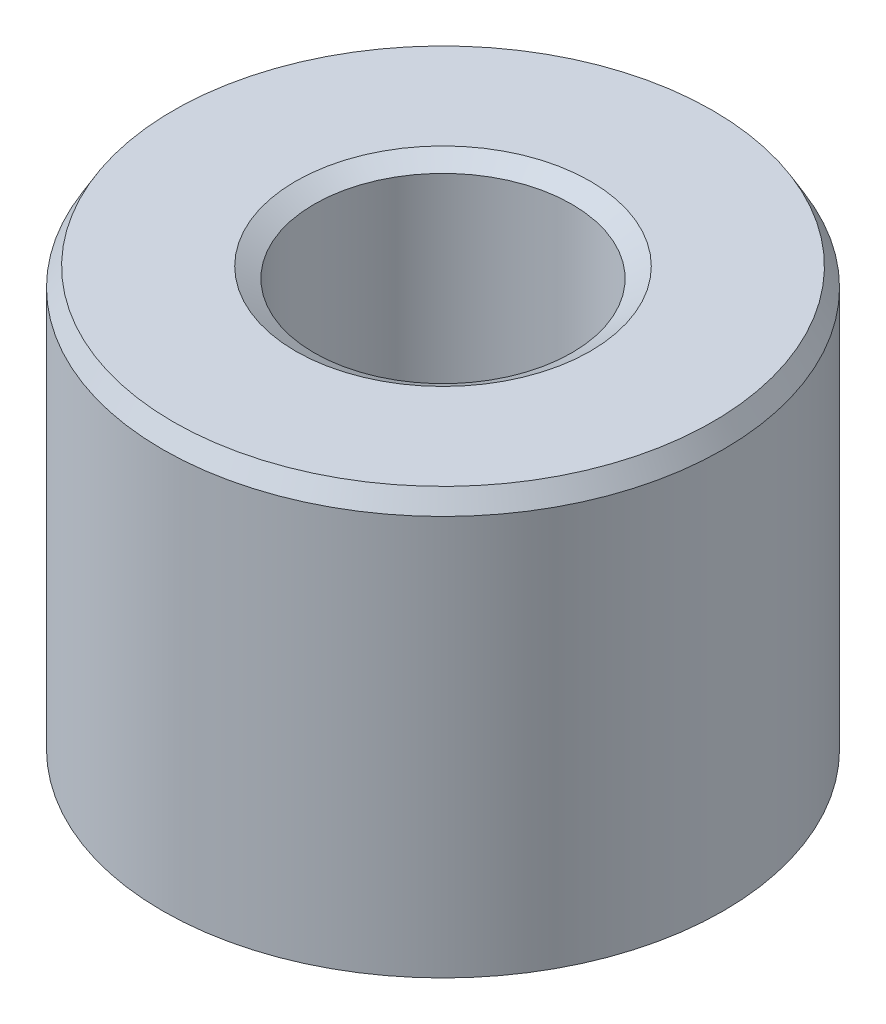
ISO-10303-21;
HEADER;
FILE_DESCRIPTION(('STEP AP214'),'2;1');
FILE_NAME('part.step','',(''),(''),'','','');
FILE_SCHEMA(('AUTOMOTIVE_DESIGN { 1 0 10303 214 1 1 1 1 }'));
ENDSEC;
DATA;
#1=APPLICATION_CONTEXT('core data for automotive mechanical design processes');
#2=APPLICATION_PROTOCOL_DEFINITION('international standard','automotive_design',2000,#1);
#3=PRODUCT_CONTEXT('',#1,'mechanical');
#4=PRODUCT('Part','Part','',(#3));
#5=PRODUCT_RELATED_PRODUCT_CATEGORY('part','',(#4));
#6=PRODUCT_DEFINITION_FORMATION('','',#4);
#7=PRODUCT_DEFINITION_CONTEXT('part definition',#1,'design');
#8=PRODUCT_DEFINITION('design','',#6,#7);
#9=PRODUCT_DEFINITION_SHAPE('','',#8);
#10=(LENGTH_UNIT() NAMED_UNIT(*) SI_UNIT(.MILLI.,.METRE.));
#11=(NAMED_UNIT(*) PLANE_ANGLE_UNIT() SI_UNIT($,.RADIAN.));
#12=(NAMED_UNIT(*) SI_UNIT($,.STERADIAN.) SOLID_ANGLE_UNIT());
#13=UNCERTAINTY_MEASURE_WITH_UNIT(LENGTH_MEASURE(1.E-05),#10,'distance_accuracy_value','');
#14=(GEOMETRIC_REPRESENTATION_CONTEXT(3) GLOBAL_UNCERTAINTY_ASSIGNED_CONTEXT((#13)) GLOBAL_UNIT_ASSIGNED_CONTEXT((#10,
#11,#12)) REPRESENTATION_CONTEXT('',''));
#15=CARTESIAN_POINT('',(0.,0.,0.));
#16=DIRECTION('',(0.,0.,1.));
#17=DIRECTION('',(1.,0.,0.));
#18=AXIS2_PLACEMENT_3D('',#15,#16,#17);
#19=CARTESIAN_POINT('',(0.,15.294510858387,0.));
#20=DIRECTION('',(0.,-1.,0.));
#21=DIRECTION('',(0.,0.,-1.));
#22=AXIS2_PLACEMENT_3D('',#19,#20,#21);
#23=CYLINDRICAL_SURFACE('',#22,10.);
#24=CARTESIAN_POINT('',(0.,0.381015982959275,0.));
#25=DIRECTION('',(0.,1.,0.));
#26=DIRECTION('',(0.,0.,1.));
#27=AXIS2_PLACEMENT_3D('',#24,#25,#26);
#28=CIRCLE('',#27,10.);
#29=CARTESIAN_POINT('',(0.,0.381015982959275,10.));
#30=VERTEX_POINT('',#29);
#31=EDGE_CURVE('E10',#30,#30,#28,.T.);
#32=ORIENTED_EDGE('',*,*,#31,.T.);
#33=EDGE_LOOP('',(#32));
#34=FACE_BOUND('',#33,.T.);
#35=CARTESIAN_POINT('',(0.,14.6345718174057,0.));
#36=DIRECTION('',(0.,1.,0.));
#37=DIRECTION('',(0.,0.,1.));
#38=AXIS2_PLACEMENT_3D('',#35,#36,#37);
#39=CIRCLE('',#38,10.);
#40=CARTESIAN_POINT('',(0.,14.6345718174057,10.));
#41=VERTEX_POINT('',#40);
#42=EDGE_CURVE('E50',#41,#41,#39,.F.);
#43=ORIENTED_EDGE('',*,*,#42,.T.);
#44=EDGE_LOOP('',(#43));
#45=FACE_BOUND('',#44,.T.);
#46=ADVANCED_FACE('F39',(#34,#45),#23,.T.);
#47=CARTESIAN_POINT('',(0.,15.294510858387,0.));
#48=DIRECTION('',(0.,1.,0.));
#49=DIRECTION('',(0.,0.,1.));
#50=AXIS2_PLACEMENT_3D('',#47,#48,#49);
#51=PLANE('',#50);
#52=CARTESIAN_POINT('',(0.,15.294510858387,0.));
#53=DIRECTION('',(0.,1.,0.));
#54=DIRECTION('',(0.,0.,1.));
#55=AXIS2_PLACEMENT_3D('',#52,#53,#54);
#56=CIRCLE('',#55,5.25326903872654);
#57=CARTESIAN_POINT('',(0.,15.294510858387,5.25326903872654));
#58=VERTEX_POINT('',#57);
#59=EDGE_CURVE('E58',#58,#58,#56,.F.);
#60=ORIENTED_EDGE('',*,*,#59,.T.);
#61=EDGE_LOOP('',(#60));
#62=FACE_BOUND('',#61,.T.);
#63=CARTESIAN_POINT('',(0.,15.294510858387,0.));
#64=DIRECTION('',(0.,1.,0.));
#65=DIRECTION('',(0.,0.,1.));
#66=AXIS2_PLACEMENT_3D('',#63,#64,#65);
#67=CIRCLE('',#66,9.61898401704072);
#68=CARTESIAN_POINT('',(0.,15.294510858387,9.61898401704072));
#69=VERTEX_POINT('',#68);
#70=EDGE_CURVE('E61',#69,#69,#67,.T.);
#71=ORIENTED_EDGE('',*,*,#70,.T.);
#72=EDGE_LOOP('',(#71));
#73=FACE_BOUND('',#72,.T.);
#74=ADVANCED_FACE('F88',(#62,#73),#51,.T.);
#75=CARTESIAN_POINT('',(0.,0.,0.));
#76=DIRECTION('',(0.,1.,0.));
#77=DIRECTION('',(0.,0.,1.));
#78=AXIS2_PLACEMENT_3D('',#75,#76,#77);
#79=PLANE('',#78);
#80=CARTESIAN_POINT('',(0.,0.,0.));
#81=DIRECTION('',(0.,1.,0.));
#82=DIRECTION('',(0.,0.,1.));
#83=AXIS2_PLACEMENT_3D('',#80,#81,#82);
#84=CIRCLE('',#83,4.97434598070453);
#85=CARTESIAN_POINT('',(0.,0.,4.97434598070453));
#86=VERTEX_POINT('',#85);
#87=EDGE_CURVE('E51',#86,#86,#84,.T.);
#88=ORIENTED_EDGE('',*,*,#87,.T.);
#89=EDGE_LOOP('',(#88));
#90=FACE_BOUND('',#89,.T.);
#91=CARTESIAN_POINT('',(0.,0.,0.));
#92=DIRECTION('',(0.,1.,0.));
#93=DIRECTION('',(0.,0.,1.));
#94=AXIS2_PLACEMENT_3D('',#91,#92,#93);
#95=CIRCLE('',#94,9.34006095901873);
#96=CARTESIAN_POINT('',(0.,0.,9.34006095901873));
#97=VERTEX_POINT('',#96);
#98=EDGE_CURVE('E54',#97,#97,#95,.F.);
#99=ORIENTED_EDGE('',*,*,#98,.T.);
#100=EDGE_LOOP('',(#99));
#101=FACE_BOUND('',#100,.T.);
#102=ADVANCED_FACE('F83',(#90,#101),#79,.F.);
#103=CARTESIAN_POINT('',(0.,15.294510858387,0.));
#104=DIRECTION('',(0.,-1.,0.));
#105=DIRECTION('',(0.,0.,-1.));
#106=AXIS2_PLACEMENT_3D('',#103,#104,#105);
#107=CYLINDRICAL_SURFACE('',#106,4.59332999774526);
#108=CARTESIAN_POINT('',(0.,14.9134948754277,0.));
#109=DIRECTION('',(0.,1.,0.));
#110=DIRECTION('',(0.,0.,1.));
#111=AXIS2_PLACEMENT_3D('',#108,#109,#110);
#112=CIRCLE('',#111,4.59332999774526);
#113=CARTESIAN_POINT('',(0.,14.9134948754277,4.59332999774526));
#114=VERTEX_POINT('',#113);
#115=EDGE_CURVE('E67',#114,#114,#112,.T.);
#116=ORIENTED_EDGE('',*,*,#115,.T.);
#117=EDGE_LOOP('',(#116));
#118=FACE_BOUND('',#117,.T.);
#119=CARTESIAN_POINT('',(0.,0.65993904098127,0.));
#120=DIRECTION('',(0.,1.,0.));
#121=DIRECTION('',(0.,0.,1.));
#122=AXIS2_PLACEMENT_3D('',#119,#120,#121);
#123=CIRCLE('',#122,4.59332999774526);
#124=CARTESIAN_POINT('',(0.,0.65993904098127,4.59332999774526));
#125=VERTEX_POINT('',#124);
#126=EDGE_CURVE('E69',#125,#125,#123,.F.);
#127=ORIENTED_EDGE('',*,*,#126,.T.);
#128=EDGE_LOOP('',(#127));
#129=FACE_BOUND('',#128,.T.);
#130=ADVANCED_FACE('F71',(#118,#129),#107,.F.);
#131=CARTESIAN_POINT('',(0.,14.9134948754277,0.));
#132=DIRECTION('',(0.,1.,0.));
#133=DIRECTION('',(0.,0.,1.));
#134=AXIS2_PLACEMENT_3D('',#131,#132,#133);
#135=CONICAL_SURFACE('',#134,4.59332999774526,1.0471975511966);
#136=CARTESIAN_POINT('',(0.,15.294510858387,5.25326903872654));
#137=CARTESIAN_POINT('',(0.,15.2905419418978,5.24639467371631));
#138=CARTESIAN_POINT('',(0.,15.2865730254087,5.23952030870609));
#139=CARTESIAN_POINT('',(0.,15.2786351924304,5.22577157868565));
#140=CARTESIAN_POINT('',(0.,15.2746662759412,5.21889721367543));
#141=CARTESIAN_POINT('',(0.,15.2667284429629,5.20514848365498));
#142=CARTESIAN_POINT('',(0.,15.2627595264737,5.19827411864476));
#143=CARTESIAN_POINT('',(0.,15.2548216934954,5.18452538862432));
#144=CARTESIAN_POINT('',(0.,15.2508527770063,5.1776510236141));
#145=CARTESIAN_POINT('',(0.,15.2429149440279,5.16390229359365));
#146=CARTESIAN_POINT('',(0.,15.2389460275388,5.15702792858343));
#147=CARTESIAN_POINT('',(0.,15.2310081945605,5.14327919856299));
#148=CARTESIAN_POINT('',(0.,15.2270392780713,5.13640483355277));
#149=CARTESIAN_POINT('',(0.,15.219101445093,5.12265610353233));
#150=CARTESIAN_POINT('',(0.,15.2151325286038,5.1157817385221));
#151=CARTESIAN_POINT('',(0.,15.2071946956255,5.10203300850166));
#152=CARTESIAN_POINT('',(0.,15.2032257791363,5.09515864349144));
#153=CARTESIAN_POINT('',(0.,15.195287946158,5.08140991347099));
#154=CARTESIAN_POINT('',(0.,15.1913190296689,5.07453554846077));
#155=CARTESIAN_POINT('',(0.,15.1833811966905,5.06078681844033));
#156=CARTESIAN_POINT('',(0.,15.1794122802014,5.05391245343011));
#157=CARTESIAN_POINT('',(0.,15.1714744472231,5.04016372340967));
#158=CARTESIAN_POINT('',(0.,15.1675055307339,5.03328935839944));
#159=CARTESIAN_POINT('',(0.,15.1595676977556,5.019540628379));
#160=CARTESIAN_POINT('',(0.,15.1555987812664,5.01266626336878));
#161=CARTESIAN_POINT('',(0.,15.1476609482881,4.99891753334834));
#162=CARTESIAN_POINT('',(0.,15.143692031799,4.99204316833811));
#163=CARTESIAN_POINT('',(0.,15.1357541988206,4.97829443831767));
#164=CARTESIAN_POINT('',(0.,15.1317852823315,4.97142007330745));
#165=CARTESIAN_POINT('',(0.,15.1238474493532,4.95767134328701));
#166=CARTESIAN_POINT('',(0.,15.119878532864,4.95079697827678));
#167=CARTESIAN_POINT('',(0.,15.1119406998857,4.93704824825634));
#168=CARTESIAN_POINT('',(0.,15.1079717833965,4.93017388324612));
#169=CARTESIAN_POINT('',(0.,15.1000339504182,4.91642515322568));
#170=CARTESIAN_POINT('',(0.,15.096065033929,4.90955078821545));
#171=CARTESIAN_POINT('',(0.,15.0881272009507,4.89580205819501));
#172=CARTESIAN_POINT('',(0.,15.0841582844616,4.88892769318479));
#173=CARTESIAN_POINT('',(0.,15.0762204514832,4.87517896316434));
#174=CARTESIAN_POINT('',(0.,15.0722515349941,4.86830459815412));
#175=CARTESIAN_POINT('',(0.,15.0643137020158,4.85455586813368));
#176=CARTESIAN_POINT('',(0.,15.0603447855266,4.84768150312346));
#177=CARTESIAN_POINT('',(0.,15.0524069525483,4.83393277310302));
#178=CARTESIAN_POINT('',(0.,15.0484380360591,4.82705840809279));
#179=CARTESIAN_POINT('',(0.,15.0405002030808,4.81330967807235));
#180=CARTESIAN_POINT('',(0.,15.0365312865917,4.80643531306213));
#181=CARTESIAN_POINT('',(0.,15.0285934536133,4.79268658304168));
#182=CARTESIAN_POINT('',(0.,15.0246245371242,4.78581221803146));
#183=CARTESIAN_POINT('',(0.,15.0166867041459,4.77206348801102));
#184=CARTESIAN_POINT('',(0.,15.0127177876567,4.7651891230008));
#185=CARTESIAN_POINT('',(0.,15.0047799546784,4.75144039298036));
#186=CARTESIAN_POINT('',(0.,15.0008110381892,4.74456602797013));
#187=CARTESIAN_POINT('',(0.,14.9928732052109,4.73081729794969));
#188=CARTESIAN_POINT('',(0.,14.9889042887217,4.72394293293947));
#189=CARTESIAN_POINT('',(0.,14.9809664557434,4.71019420291903));
#190=CARTESIAN_POINT('',(0.,14.9769975392543,4.7033198379088));
#191=CARTESIAN_POINT('',(0.,14.969059706276,4.68957110788836));
#192=CARTESIAN_POINT('',(0.,14.9650907897868,4.68269674287814));
#193=CARTESIAN_POINT('',(0.,14.9571529568085,4.6689480128577));
#194=CARTESIAN_POINT('',(0.,14.9531840403193,4.66207364784747));
#195=CARTESIAN_POINT('',(0.,14.945246207341,4.64832491782703));
#196=CARTESIAN_POINT('',(0.,14.9412772908518,4.64145055281681));
#197=CARTESIAN_POINT('',(0.,14.9333394578735,4.62770182279637));
#198=CARTESIAN_POINT('',(0.,14.9293705413844,4.62082745778614));
#199=CARTESIAN_POINT('',(0.,14.921432708406,4.6070787277657));
#200=CARTESIAN_POINT('',(0.,14.9174637919169,4.60020436275548));
#201=CARTESIAN_POINT('',(0.,14.9134948754277,4.59332999774526));
#202=B_SPLINE_CURVE_WITH_KNOTS('',3,(#136,#137,#138,#139,#140,#141,#142,#143,#144,#145,#146,
#147,#148,#149,#150,#151,#152,#153,#154,#155,#156,#157,#158,#159,#160,#161,#162,#163,#164,#165,
#166,#167,#168,#169,#170,#171,#172,#173,#174,#175,#176,#177,#178,#179,#180,#181,#182,#183,#184,
#185,#186,#187,#188,#189,#190,#191,#192,#193,#194,#195,#196,#197,#198,#199,#200,#201),
.UNSPECIFIED.,.F.,.F.,(4,2,2,2,2,2,2,2,2,2,2,2,2,2,2,2,2,2,2,2,2,2,2,2,2,2,2,2,2,2,2,2,4),(0.,
0.0238134989349546,0.0476269978699101,0.0714404968048648,0.095253995739821,0.119067494674776,
0.142880993609731,0.166694492544686,0.190507991479642,0.214321490414597,0.238134989349552,
0.261948488284507,0.285761987219462,0.309575486154418,0.333388985089373,0.357202484024328,
0.381015982959283,0.404829481894238,0.428642980829194,0.452456479764149,0.476269978699104,
0.500083477634059,0.523896976569015,0.54771047550397,0.571523974438925,0.59533747337388,
0.619150972308836,0.642964471243791,0.666777970178747,0.690591469113701,0.714404968048657,
0.738218466983612,0.762031965918567),.UNSPECIFIED.);
#203=EDGE_CURVE('BSEAM77',#58,#114,#202,.T.);
#204=ORIENTED_EDGE('',*,*,#59,.F.);
#205=ORIENTED_EDGE('',*,*,#115,.F.);
#206=ORIENTED_EDGE('',*,*,#203,.T.);
#207=ORIENTED_EDGE('',*,*,#203,.F.);
#208=EDGE_LOOP('',(#204,#206,#205,#207));
#209=FACE_BOUND('',#208,.T.);
#210=ADVANCED_FACE('F77',(#209),#135,.F.);
#211=CARTESIAN_POINT('',(0.,0.,0.));
#212=DIRECTION('',(0.,-1.,0.));
#213=DIRECTION('',(0.,0.,-1.));
#214=AXIS2_PLACEMENT_3D('',#211,#212,#213);
#215=CONICAL_SURFACE('',#214,4.97434598070453,0.523598775598294);
#216=ORIENTED_EDGE('',*,*,#126,.F.);
#217=EDGE_LOOP('',(#216));
#218=FACE_BOUND('',#217,.T.);
#219=ORIENTED_EDGE('',*,*,#87,.F.);
#220=EDGE_LOOP('',(#219));
#221=FACE_BOUND('',#220,.T.);
#222=ADVANCED_FACE('F73',(#218,#221),#215,.F.);
#223=CARTESIAN_POINT('',(0.,0.381015982959275,0.));
#224=DIRECTION('',(0.,1.,0.));
#225=DIRECTION('',(0.,0.,1.));
#226=AXIS2_PLACEMENT_3D('',#223,#224,#225);
#227=CONICAL_SURFACE('',#226,10.,1.0471975511966);
#228=CARTESIAN_POINT('',(0.,0.,9.34006095901873));
#229=CARTESIAN_POINT('',(0.,0.00396891648915906,9.34693532402895));
#230=CARTESIAN_POINT('',(0.,0.00793783297831817,9.35380968903918));
#231=CARTESIAN_POINT('',(0.,0.0158756659566364,9.36755841905962));
#232=CARTESIAN_POINT('',(0.,0.0198445824457955,9.37443278406984));
#233=CARTESIAN_POINT('',(0.,0.0277824154241137,9.38818151409028));
#234=CARTESIAN_POINT('',(0.,0.0317513319132729,9.39505587910051));
#235=CARTESIAN_POINT('',(0.,0.0396891648915911,9.40880460912095));
#236=CARTESIAN_POINT('',(0.,0.0436580813807502,9.41567897413117));
#237=CARTESIAN_POINT('',(0.,0.0515959143590684,9.42942770415161));
#238=CARTESIAN_POINT('',(0.,0.0555648308482275,9.43630206916183));
#239=CARTESIAN_POINT('',(0.,0.0635026638265458,9.45005079918228));
#240=CARTESIAN_POINT('',(0.,0.0674715803157049,9.4569251641925));
#241=CARTESIAN_POINT('',(0.,0.0754094132940231,9.47067389421294));
#242=CARTESIAN_POINT('',(0.,0.0793783297831821,9.47754825922316));
#243=CARTESIAN_POINT('',(0.,0.0873161627615004,9.49129698924361));
#244=CARTESIAN_POINT('',(0.,0.0912850792506597,9.49817135425383));
#245=CARTESIAN_POINT('',(0.,0.0992229122289779,9.51192008427427));
#246=CARTESIAN_POINT('',(0.,0.103191828718137,9.51879444928449));
#247=CARTESIAN_POINT('',(0.,0.111129661696455,9.53254317930494));
#248=CARTESIAN_POINT('',(0.,0.115098578185614,9.53941754431516));
#249=CARTESIAN_POINT('',(0.,0.123036411163932,9.5531662743356));
#250=CARTESIAN_POINT('',(0.,0.127005327653092,9.56004063934582));
#251=CARTESIAN_POINT('',(0.,0.13494316063141,9.57378936936627));
#252=CARTESIAN_POINT('',(0.,0.138912077120569,9.58066373437649));
#253=CARTESIAN_POINT('',(0.,0.146849910098887,9.59441246439693));
#254=CARTESIAN_POINT('',(0.,0.150818826588046,9.60128682940715));
#255=CARTESIAN_POINT('',(0.,0.158756659566365,9.61503555942759));
#256=CARTESIAN_POINT('',(0.,0.162725576055524,9.62190992443782));
#257=CARTESIAN_POINT('',(0.,0.170663409033842,9.63565865445826));
#258=CARTESIAN_POINT('',(0.,0.174632325523001,9.64253301946848));
#259=CARTESIAN_POINT('',(0.,0.182570158501319,9.65628174948892));
#260=CARTESIAN_POINT('',(0.,0.186539074990478,9.66315611449915));
#261=CARTESIAN_POINT('',(0.,0.194476907968797,9.67690484451959));
#262=CARTESIAN_POINT('',(0.,0.198445824457956,9.68377920952981));
#263=CARTESIAN_POINT('',(0.,0.206383657436274,9.69752793955026));
#264=CARTESIAN_POINT('',(0.,0.210352573925433,9.70440230456047));
#265=CARTESIAN_POINT('',(0.,0.218290406903751,9.71815103458092));
#266=CARTESIAN_POINT('',(0.,0.22225932339291,9.72502539959114));
#267=CARTESIAN_POINT('',(0.,0.230197156371229,9.73877412961158));
#268=CARTESIAN_POINT('',(0.,0.234166072860388,9.7456484946218));
#269=CARTESIAN_POINT('',(0.,0.242103905838706,9.75939722464225));
#270=CARTESIAN_POINT('',(0.,0.246072822327865,9.76627158965247));
#271=CARTESIAN_POINT('',(0.,0.254010655306183,9.78002031967291));
#272=CARTESIAN_POINT('',(0.,0.257979571795342,9.78689468468313));
#273=CARTESIAN_POINT('',(0.,0.26591740477366,9.80064341470358));
#274=CARTESIAN_POINT('',(0.,0.26988632126282,9.8075177797138));
#275=CARTESIAN_POINT('',(0.,0.277824154241138,9.82126650973424));
#276=CARTESIAN_POINT('',(0.,0.281793070730297,9.82814087474446));
#277=CARTESIAN_POINT('',(0.,0.289730903708615,9.84188960476491));
#278=CARTESIAN_POINT('',(0.,0.293699820197774,9.84876396977513));
#279=CARTESIAN_POINT('',(0.,0.301637653176093,9.86251269979557));
#280=CARTESIAN_POINT('',(0.,0.305606569665252,9.86938706480579));
#281=CARTESIAN_POINT('',(0.,0.31354440264357,9.88313579482624));
#282=CARTESIAN_POINT('',(0.,0.317513319132729,9.89001015983646));
#283=CARTESIAN_POINT('',(0.,0.325451152111047,9.9037588898569));
#284=CARTESIAN_POINT('',(0.,0.329420068600206,9.91063325486712));
#285=CARTESIAN_POINT('',(0.,0.337357901578525,9.92438198488757));
#286=CARTESIAN_POINT('',(0.,0.341326818067684,9.93125634989778));
#287=CARTESIAN_POINT('',(0.,0.349264651046002,9.94500507991823));
#288=CARTESIAN_POINT('',(0.,0.353233567535161,9.95187944492845));
#289=CARTESIAN_POINT('',(0.,0.361171400513479,9.9656281749489));
#290=CARTESIAN_POINT('',(0.,0.365140317002638,9.97250253995911));
#291=CARTESIAN_POINT('',(0.,0.373078149980957,9.98625126997956));
#292=CARTESIAN_POINT('',(0.,0.377047066470116,9.99312563498978));
#293=CARTESIAN_POINT('',(0.,0.381015982959275,10.));
#294=B_SPLINE_CURVE_WITH_KNOTS('',3,(#228,#229,#230,#231,#232,#233,#234,#235,#236,#237,#238,
#239,#240,#241,#242,#243,#244,#245,#246,#247,#248,#249,#250,#251,#252,#253,#254,#255,#256,#257,
#258,#259,#260,#261,#262,#263,#264,#265,#266,#267,#268,#269,#270,#271,#272,#273,#274,#275,#276,
#277,#278,#279,#280,#281,#282,#283,#284,#285,#286,#287,#288,#289,#290,#291,#292,#293),
.UNSPECIFIED.,.F.,.F.,(4,2,2,2,2,2,2,2,2,2,2,2,2,2,2,2,2,2,2,2,2,2,2,2,2,2,2,2,2,2,2,2,4),(0.,
0.023813498934955,0.0476269978699099,0.0714404968048649,0.0952539957398199,0.119067494674775,
0.14288099360973,0.166694492544685,0.190507991479638,0.214321490414593,0.238134989349548,
0.261948488284503,0.285761987219458,0.309575486154413,0.333388985089368,0.357202484024323,
0.381015982959278,0.404829481894233,0.428642980829188,0.452456479764143,0.476269978699098,
0.500083477634053,0.523896976569008,0.547710475503963,0.571523974438916,0.595337473373871,
0.619150972308826,0.642964471243781,0.666777970178736,0.690591469113691,0.714404968048646,
0.738218466983601,0.762031965918556),.UNSPECIFIED.);
#295=EDGE_CURVE('BSEAM76',#97,#30,#294,.T.);
#296=ORIENTED_EDGE('',*,*,#98,.F.);
#297=ORIENTED_EDGE('',*,*,#31,.F.);
#298=ORIENTED_EDGE('',*,*,#295,.T.);
#299=ORIENTED_EDGE('',*,*,#295,.F.);
#300=EDGE_LOOP('',(#296,#298,#297,#299));
#301=FACE_BOUND('',#300,.T.);
#302=ADVANCED_FACE('F76',(#301),#227,.T.);
#303=CARTESIAN_POINT('',(0.,15.294510858387,0.));
#304=DIRECTION('',(0.,-1.,0.));
#305=DIRECTION('',(0.,0.,-1.));
#306=AXIS2_PLACEMENT_3D('',#303,#304,#305);
#307=CONICAL_SURFACE('',#306,9.61898401704072,0.523598775598297);
#308=ORIENTED_EDGE('',*,*,#42,.F.);
#309=EDGE_LOOP('',(#308));
#310=FACE_BOUND('',#309,.T.);
#311=ORIENTED_EDGE('',*,*,#70,.F.);
#312=EDGE_LOOP('',(#311));
#313=FACE_BOUND('',#312,.T.);
#314=ADVANCED_FACE('F45',(#310,#313),#307,.T.);
#315=CLOSED_SHELL('',(#46,#74,#102,#130,#210,#222,#302,#314));
#316=MANIFOLD_SOLID_BREP('B2',#315);
#317=ADVANCED_BREP_SHAPE_REPRESENTATION('',(#18,#316),#14);
#318=SHAPE_DEFINITION_REPRESENTATION(#9,#317);
ENDSEC;
END-ISO-10303-21;
